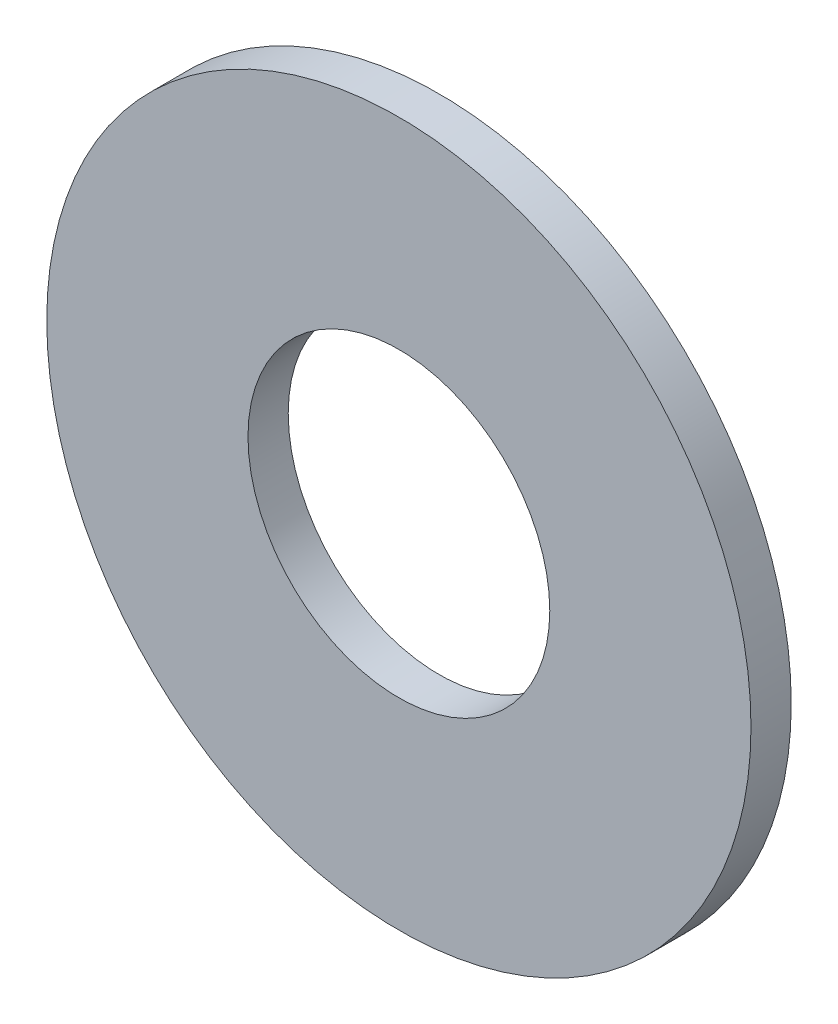
ISO-10303-21;
HEADER;
FILE_DESCRIPTION(('STEP AP214'),'2;1');
FILE_NAME('part.step','',(''),(''),'','','');
FILE_SCHEMA(('AUTOMOTIVE_DESIGN { 1 0 10303 214 1 1 1 1 }'));
ENDSEC;
DATA;
#1=APPLICATION_CONTEXT('core data for automotive mechanical design processes');
#2=APPLICATION_PROTOCOL_DEFINITION('international standard','automotive_design',2000,#1);
#3=PRODUCT_CONTEXT('',#1,'mechanical');
#4=PRODUCT('Part','Part','',(#3));
#5=PRODUCT_RELATED_PRODUCT_CATEGORY('part','',(#4));
#6=PRODUCT_DEFINITION_FORMATION('','',#4);
#7=PRODUCT_DEFINITION_CONTEXT('part definition',#1,'design');
#8=PRODUCT_DEFINITION('design','',#6,#7);
#9=PRODUCT_DEFINITION_SHAPE('','',#8);
#10=(LENGTH_UNIT() NAMED_UNIT(*) SI_UNIT(.MILLI.,.METRE.));
#11=(NAMED_UNIT(*) PLANE_ANGLE_UNIT() SI_UNIT($,.RADIAN.));
#12=(NAMED_UNIT(*) SI_UNIT($,.STERADIAN.) SOLID_ANGLE_UNIT());
#13=UNCERTAINTY_MEASURE_WITH_UNIT(LENGTH_MEASURE(1.E-05),#10,'distance_accuracy_value','');
#14=(GEOMETRIC_REPRESENTATION_CONTEXT(3) GLOBAL_UNCERTAINTY_ASSIGNED_CONTEXT((#13)) GLOBAL_UNIT_ASSIGNED_CONTEXT((#10,
#11,#12)) REPRESENTATION_CONTEXT('',''));
#15=CARTESIAN_POINT('',(0.,0.,0.));
#16=DIRECTION('',(0.,0.,1.));
#17=DIRECTION('',(1.,0.,0.));
#18=AXIS2_PLACEMENT_3D('',#15,#16,#17);
#19=CARTESIAN_POINT('',(0.,0.,2.));
#20=DIRECTION('',(0.,0.,1.));
#21=DIRECTION('',(1.,0.,0.));
#22=AXIS2_PLACEMENT_3D('',#19,#20,#21);
#23=PLANE('',#22);
#24=CARTESIAN_POINT('',(0.,0.,2.));
#25=DIRECTION('',(0.,0.,1.));
#26=DIRECTION('',(1.,0.,0.));
#27=AXIS2_PLACEMENT_3D('',#24,#25,#26);
#28=CIRCLE('',#27,17.5);
#29=CARTESIAN_POINT('',(17.5,0.,2.));
#30=VERTEX_POINT('',#29);
#31=EDGE_CURVE('E10',#30,#30,#28,.T.);
#32=ORIENTED_EDGE('',*,*,#31,.T.);
#33=EDGE_LOOP('',(#32));
#34=FACE_BOUND('',#33,.T.);
#35=CARTESIAN_POINT('',(0.,0.,2.));
#36=DIRECTION('',(0.,0.,1.));
#37=DIRECTION('',(1.,0.,0.));
#38=AXIS2_PLACEMENT_3D('',#35,#36,#37);
#39=CIRCLE('',#38,7.5);
#40=CARTESIAN_POINT('',(7.5,0.,2.));
#41=VERTEX_POINT('',#40);
#42=EDGE_CURVE('E50',#41,#41,#39,.T.);
#43=ORIENTED_EDGE('',*,*,#42,.F.);
#44=EDGE_LOOP('',(#43));
#45=FACE_BOUND('',#44,.T.);
#46=ADVANCED_FACE('F37',(#34,#45),#23,.T.);
#47=CARTESIAN_POINT('',(0.,0.,0.));
#48=DIRECTION('',(0.,0.,1.));
#49=DIRECTION('',(1.,0.,0.));
#50=AXIS2_PLACEMENT_3D('',#47,#48,#49);
#51=PLANE('',#50);
#52=CARTESIAN_POINT('',(0.,0.,0.));
#53=DIRECTION('',(0.,0.,1.));
#54=DIRECTION('',(1.,0.,0.));
#55=AXIS2_PLACEMENT_3D('',#52,#53,#54);
#56=CIRCLE('',#55,17.5);
#57=CARTESIAN_POINT('',(17.5,0.,0.));
#58=VERTEX_POINT('',#57);
#59=EDGE_CURVE('E41',#58,#58,#56,.T.);
#60=ORIENTED_EDGE('',*,*,#59,.F.);
#61=EDGE_LOOP('',(#60));
#62=FACE_BOUND('',#61,.T.);
#63=CARTESIAN_POINT('',(0.,0.,0.));
#64=DIRECTION('',(0.,0.,1.));
#65=DIRECTION('',(1.,0.,0.));
#66=AXIS2_PLACEMENT_3D('',#63,#64,#65);
#67=CIRCLE('',#66,7.5);
#68=CARTESIAN_POINT('',(7.5,0.,0.));
#69=VERTEX_POINT('',#68);
#70=EDGE_CURVE('E52',#69,#69,#67,.T.);
#71=ORIENTED_EDGE('',*,*,#70,.T.);
#72=EDGE_LOOP('',(#71));
#73=FACE_BOUND('',#72,.T.);
#74=ADVANCED_FACE('F64',(#62,#73),#51,.F.);
#75=CARTESIAN_POINT('',(0.,0.,2.));
#76=DIRECTION('',(0.,0.,-1.));
#77=DIRECTION('',(-1.,0.,0.));
#78=AXIS2_PLACEMENT_3D('',#75,#76,#77);
#79=CYLINDRICAL_SURFACE('',#78,17.5);
#80=ORIENTED_EDGE('',*,*,#31,.F.);
#81=EDGE_LOOP('',(#80));
#82=FACE_BOUND('',#81,.T.);
#83=ORIENTED_EDGE('',*,*,#59,.T.);
#84=EDGE_LOOP('',(#83));
#85=FACE_BOUND('',#84,.T.);
#86=ADVANCED_FACE('F39',(#82,#85),#79,.T.);
#87=CARTESIAN_POINT('',(0.,0.,2.));
#88=DIRECTION('',(0.,0.,-1.));
#89=DIRECTION('',(-1.,0.,0.));
#90=AXIS2_PLACEMENT_3D('',#87,#88,#89);
#91=CYLINDRICAL_SURFACE('',#90,7.5);
#92=ORIENTED_EDGE('',*,*,#42,.T.);
#93=EDGE_LOOP('',(#92));
#94=FACE_BOUND('',#93,.T.);
#95=ORIENTED_EDGE('',*,*,#70,.F.);
#96=EDGE_LOOP('',(#95));
#97=FACE_BOUND('',#96,.T.);
#98=ADVANCED_FACE('F60',(#94,#97),#91,.F.);
#99=CLOSED_SHELL('',(#46,#74,#86,#98));
#100=MANIFOLD_SOLID_BREP('B2',#99);
#101=ADVANCED_BREP_SHAPE_REPRESENTATION('',(#18,#100),#14);
#102=SHAPE_DEFINITION_REPRESENTATION(#9,#101);
ENDSEC;
END-ISO-10303-21;
